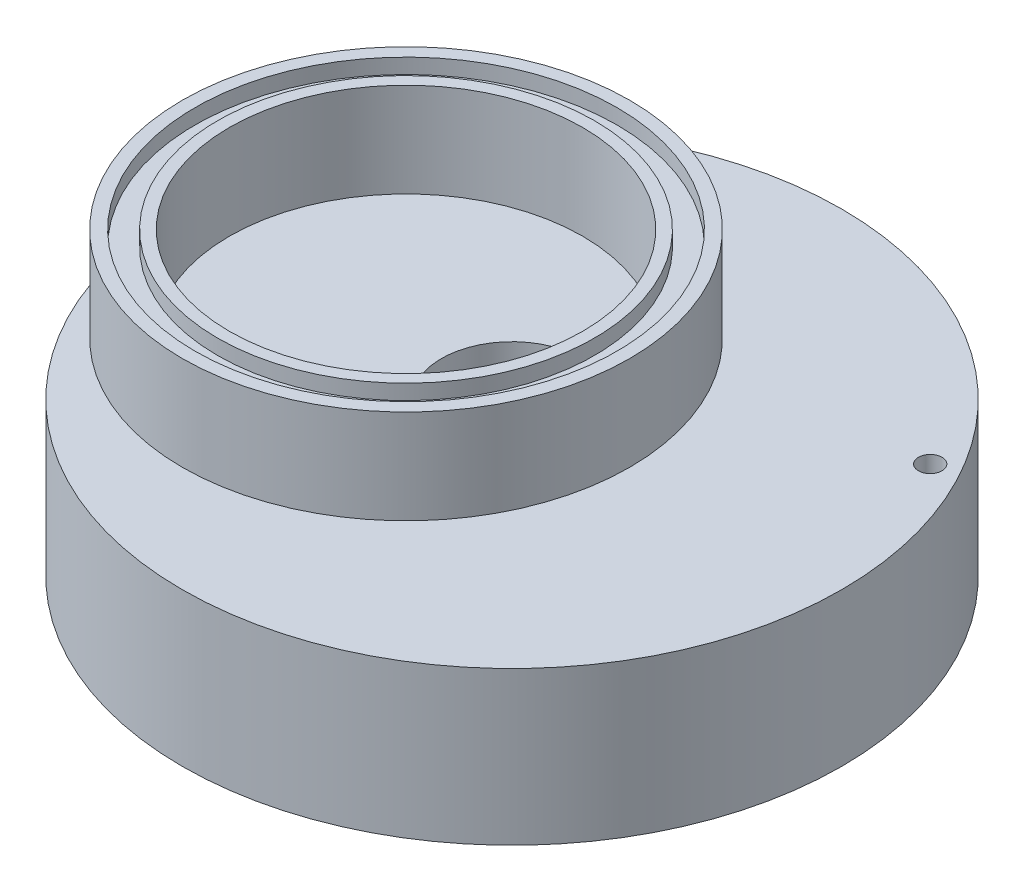
ISO-10303-21;
HEADER;
FILE_DESCRIPTION(('STEP AP214'),'2;1');
FILE_NAME('part.step','',(''),(''),'','','');
FILE_SCHEMA(('AUTOMOTIVE_DESIGN { 1 0 10303 214 1 1 1 1 }'));
ENDSEC;
DATA;
#1=APPLICATION_CONTEXT('core data for automotive mechanical design processes');
#2=APPLICATION_PROTOCOL_DEFINITION('international standard','automotive_design',2000,#1);
#3=PRODUCT_CONTEXT('',#1,'mechanical');
#4=PRODUCT('Part','Part','',(#3));
#5=PRODUCT_RELATED_PRODUCT_CATEGORY('part','',(#4));
#6=PRODUCT_DEFINITION_FORMATION('','',#4);
#7=PRODUCT_DEFINITION_CONTEXT('part definition',#1,'design');
#8=PRODUCT_DEFINITION('design','',#6,#7);
#9=PRODUCT_DEFINITION_SHAPE('','',#8);
#10=(LENGTH_UNIT() NAMED_UNIT(*) SI_UNIT(.MILLI.,.METRE.));
#11=(NAMED_UNIT(*) PLANE_ANGLE_UNIT() SI_UNIT($,.RADIAN.));
#12=(NAMED_UNIT(*) SI_UNIT($,.STERADIAN.) SOLID_ANGLE_UNIT());
#13=UNCERTAINTY_MEASURE_WITH_UNIT(LENGTH_MEASURE(1.E-05),#10,'distance_accuracy_value','');
#14=(GEOMETRIC_REPRESENTATION_CONTEXT(3) GLOBAL_UNCERTAINTY_ASSIGNED_CONTEXT((#13)) GLOBAL_UNIT_ASSIGNED_CONTEXT((#10,
#11,#12)) REPRESENTATION_CONTEXT('',''));
#15=CARTESIAN_POINT('',(0.,0.,0.));
#16=DIRECTION('',(0.,0.,1.));
#17=DIRECTION('',(1.,0.,0.));
#18=AXIS2_PLACEMENT_3D('',#15,#16,#17);
#19=CARTESIAN_POINT('',(-14.2875,12.7,0.));
#20=DIRECTION('',(0.,1.,0.));
#21=DIRECTION('',(0.,0.,1.));
#22=AXIS2_PLACEMENT_3D('',#19,#20,#21);
#23=PLANE('',#22);
#24=CARTESIAN_POINT('',(-14.2875,12.7,0.));
#25=DIRECTION('',(0.,1.,0.));
#26=DIRECTION('',(0.,0.,1.));
#27=AXIS2_PLACEMENT_3D('',#24,#25,#26);
#28=CIRCLE('',#27,23.8125);
#29=CARTESIAN_POINT('',(-14.2875,12.7,23.8125));
#30=VERTEX_POINT('',#29);
#31=EDGE_CURVE('E107',#30,#30,#28,.T.);
#32=ORIENTED_EDGE('',*,*,#31,.F.);
#33=EDGE_LOOP('',(#32));
#34=FACE_BOUND('',#33,.T.);
#35=CARTESIAN_POINT('',(-14.2875,12.7,0.));
#36=DIRECTION('',(0.,1.,0.));
#37=DIRECTION('',(0.,0.,1.));
#38=AXIS2_PLACEMENT_3D('',#35,#36,#37);
#39=CIRCLE('',#38,25.4);
#40=CARTESIAN_POINT('',(-14.2875,12.7,25.4));
#41=VERTEX_POINT('',#40);
#42=EDGE_CURVE('E91',#41,#41,#39,.T.);
#43=ORIENTED_EDGE('',*,*,#42,.T.);
#44=EDGE_LOOP('',(#43));
#45=FACE_BOUND('',#44,.T.);
#46=ADVANCED_FACE('F39',(#34,#45),#23,.T.);
#47=CARTESIAN_POINT('',(-9.525,0.,0.));
#48=DIRECTION('',(0.,-1.,0.));
#49=DIRECTION('',(0.,0.,-1.));
#50=AXIS2_PLACEMENT_3D('',#47,#48,#49);
#51=PLANE('',#50);
#52=CARTESIAN_POINT('',(0.,0.,0.));
#53=DIRECTION('',(0.,-1.,0.));
#54=DIRECTION('',(0.,0.,-1.));
#55=AXIS2_PLACEMENT_3D('',#52,#53,#54);
#56=CIRCLE('',#55,9.525);
#57=CARTESIAN_POINT('',(9.525,0.,0.));
#58=VERTEX_POINT('',#57);
#59=EDGE_CURVE('E125',#58,#58,#56,.T.);
#60=ORIENTED_EDGE('',*,*,#59,.T.);
#61=CARTESIAN_POINT('',(-14.2875,0.,0.));
#62=DIRECTION('',(0.,1.,0.));
#63=DIRECTION('',(0.,0.,1.));
#64=AXIS2_PLACEMENT_3D('',#61,#62,#63);
#65=CIRCLE('',#64,23.8125);
#66=EDGE_CURVE('E53',#58,#58,#65,.T.);
#67=ORIENTED_EDGE('',*,*,#66,.T.);
#68=EDGE_LOOP('',(#60,#67));
#69=FACE_BOUND('',#68,.T.);
#70=ADVANCED_FACE('F222',(#69),#51,.F.);
#71=CARTESIAN_POINT('',(-9.525,-6.35,0.));
#72=DIRECTION('',(0.,1.,0.));
#73=DIRECTION('',(0.,0.,1.));
#74=AXIS2_PLACEMENT_3D('',#71,#72,#73);
#75=PLANE('',#74);
#76=CARTESIAN_POINT('',(0.,-6.35,0.));
#77=DIRECTION('',(0.,-1.,0.));
#78=DIRECTION('',(0.,0.,-1.));
#79=AXIS2_PLACEMENT_3D('',#76,#77,#78);
#80=CIRCLE('',#79,9.525);
#81=CARTESIAN_POINT('',(0.,-6.35,-9.525));
#82=VERTEX_POINT('',#81);
#83=EDGE_CURVE('E118',#82,#82,#80,.T.);
#84=ORIENTED_EDGE('',*,*,#83,.F.);
#85=EDGE_LOOP('',(#84));
#86=FACE_BOUND('',#85,.T.);
#87=CARTESIAN_POINT('',(0.,-6.35,0.));
#88=DIRECTION('',(0.,-1.,0.));
#89=DIRECTION('',(0.,0.,-1.));
#90=AXIS2_PLACEMENT_3D('',#87,#88,#89);
#91=CIRCLE('',#90,15.875);
#92=CARTESIAN_POINT('',(0.,-6.35,-15.875));
#93=VERTEX_POINT('',#92);
#94=EDGE_CURVE('E11',#93,#93,#91,.T.);
#95=ORIENTED_EDGE('',*,*,#94,.T.);
#96=EDGE_LOOP('',(#95));
#97=FACE_BOUND('',#96,.T.);
#98=ADVANCED_FACE('F41',(#86,#97),#75,.F.);
#99=CARTESIAN_POINT('',(0.,-19.05,0.));
#100=DIRECTION('',(0.,-1.,0.));
#101=DIRECTION('',(0.,0.,-1.));
#102=AXIS2_PLACEMENT_3D('',#99,#100,#101);
#103=CONICAL_SURFACE('',#102,31.75,0.896055384571344);
#104=ORIENTED_EDGE('',*,*,#94,.F.);
#105=EDGE_LOOP('',(#104));
#106=FACE_BOUND('',#105,.T.);
#107=CARTESIAN_POINT('',(0.,-19.05,0.));
#108=DIRECTION('',(0.,-1.,0.));
#109=DIRECTION('',(0.,0.,-1.));
#110=AXIS2_PLACEMENT_3D('',#107,#108,#109);
#111=CIRCLE('',#110,31.75);
#112=CARTESIAN_POINT('',(0.,-19.05,-31.75));
#113=VERTEX_POINT('',#112);
#114=EDGE_CURVE('E48',#113,#113,#111,.T.);
#115=ORIENTED_EDGE('',*,*,#114,.T.);
#116=EDGE_LOOP('',(#115));
#117=FACE_BOUND('',#116,.T.);
#118=ADVANCED_FACE('F158',(#106,#117),#103,.F.);
#119=CARTESIAN_POINT('',(0.,0.,0.));
#120=DIRECTION('',(0.,-1.,0.));
#121=DIRECTION('',(0.,0.,-1.));
#122=AXIS2_PLACEMENT_3D('',#119,#120,#121);
#123=CYLINDRICAL_SURFACE('',#122,31.75);
#124=ORIENTED_EDGE('',*,*,#114,.F.);
#125=EDGE_LOOP('',(#124));
#126=FACE_BOUND('',#125,.T.);
#127=CARTESIAN_POINT('',(0.,-20.6375,0.));
#128=DIRECTION('',(0.,-1.,0.));
#129=DIRECTION('',(0.,0.,-1.));
#130=AXIS2_PLACEMENT_3D('',#127,#128,#129);
#131=CIRCLE('',#130,31.75);
#132=CARTESIAN_POINT('',(0.,-20.6375,-31.75));
#133=VERTEX_POINT('',#132);
#134=EDGE_CURVE('E151',#133,#133,#131,.T.);
#135=ORIENTED_EDGE('',*,*,#134,.T.);
#136=EDGE_LOOP('',(#135));
#137=FACE_BOUND('',#136,.T.);
#138=ADVANCED_FACE('F160',(#126,#137),#123,.F.);
#139=CARTESIAN_POINT('',(-33.3375,-20.6375,0.));
#140=DIRECTION('',(0.,1.,0.));
#141=DIRECTION('',(0.,0.,1.));
#142=AXIS2_PLACEMENT_3D('',#139,#140,#141);
#143=PLANE('',#142);
#144=ORIENTED_EDGE('',*,*,#134,.F.);
#145=EDGE_LOOP('',(#144));
#146=FACE_BOUND('',#145,.T.);
#147=CARTESIAN_POINT('',(0.,-20.6375,0.));
#148=DIRECTION('',(0.,-1.,0.));
#149=DIRECTION('',(0.,0.,-1.));
#150=AXIS2_PLACEMENT_3D('',#147,#148,#149);
#151=CIRCLE('',#150,33.3375);
#152=CARTESIAN_POINT('',(0.,-20.6375,-33.3375));
#153=VERTEX_POINT('',#152);
#154=EDGE_CURVE('E147',#153,#153,#151,.T.);
#155=ORIENTED_EDGE('',*,*,#154,.T.);
#156=EDGE_LOOP('',(#155));
#157=FACE_BOUND('',#156,.T.);
#158=ADVANCED_FACE('F163',(#146,#157),#143,.F.);
#159=CARTESIAN_POINT('',(0.,0.,0.));
#160=DIRECTION('',(0.,-1.,0.));
#161=DIRECTION('',(0.,0.,-1.));
#162=AXIS2_PLACEMENT_3D('',#159,#160,#161);
#163=CYLINDRICAL_SURFACE('',#162,33.3375);
#164=ORIENTED_EDGE('',*,*,#154,.F.);
#165=EDGE_LOOP('',(#164));
#166=FACE_BOUND('',#165,.T.);
#167=CARTESIAN_POINT('',(0.,-18.6055,0.));
#168=DIRECTION('',(0.,-1.,0.));
#169=DIRECTION('',(0.,0.,-1.));
#170=AXIS2_PLACEMENT_3D('',#167,#168,#169);
#171=CIRCLE('',#170,33.3375);
#172=CARTESIAN_POINT('',(0.,-18.6055,-33.3375));
#173=VERTEX_POINT('',#172);
#174=EDGE_CURVE('E143',#173,#173,#171,.T.);
#175=ORIENTED_EDGE('',*,*,#174,.T.);
#176=EDGE_LOOP('',(#175));
#177=FACE_BOUND('',#176,.T.);
#178=ADVANCED_FACE('F169',(#166,#177),#163,.T.);
#179=CARTESIAN_POINT('',(-36.3855,-18.6055,0.));
#180=DIRECTION('',(0.,1.,0.));
#181=DIRECTION('',(0.,0.,1.));
#182=AXIS2_PLACEMENT_3D('',#179,#180,#181);
#183=PLANE('',#182);
#184=ORIENTED_EDGE('',*,*,#174,.F.);
#185=EDGE_LOOP('',(#184));
#186=FACE_BOUND('',#185,.T.);
#187=CARTESIAN_POINT('',(0.,-18.6055,0.));
#188=DIRECTION('',(0.,-1.,0.));
#189=DIRECTION('',(0.,0.,-1.));
#190=AXIS2_PLACEMENT_3D('',#187,#188,#189);
#191=CIRCLE('',#190,36.3855);
#192=CARTESIAN_POINT('',(0.,-18.6055,-36.3855));
#193=VERTEX_POINT('',#192);
#194=EDGE_CURVE('E139',#193,#193,#191,.T.);
#195=ORIENTED_EDGE('',*,*,#194,.T.);
#196=EDGE_LOOP('',(#195));
#197=FACE_BOUND('',#196,.T.);
#198=ADVANCED_FACE('F175',(#186,#197),#183,.F.);
#199=CARTESIAN_POINT('',(0.,0.,0.));
#200=DIRECTION('',(0.,-1.,0.));
#201=DIRECTION('',(0.,0.,-1.));
#202=AXIS2_PLACEMENT_3D('',#199,#200,#201);
#203=CYLINDRICAL_SURFACE('',#202,36.3855);
#204=ORIENTED_EDGE('',*,*,#194,.F.);
#205=EDGE_LOOP('',(#204));
#206=FACE_BOUND('',#205,.T.);
#207=CARTESIAN_POINT('',(0.,-20.6375,0.));
#208=DIRECTION('',(0.,-1.,0.));
#209=DIRECTION('',(0.,0.,-1.));
#210=AXIS2_PLACEMENT_3D('',#207,#208,#209);
#211=CIRCLE('',#210,36.3855);
#212=CARTESIAN_POINT('',(0.,-20.6375,-36.3855));
#213=VERTEX_POINT('',#212);
#214=EDGE_CURVE('E135',#213,#213,#211,.T.);
#215=ORIENTED_EDGE('',*,*,#214,.T.);
#216=EDGE_LOOP('',(#215));
#217=FACE_BOUND('',#216,.T.);
#218=ADVANCED_FACE('F181',(#206,#217),#203,.F.);
#219=CARTESIAN_POINT('',(-44.45,-20.6375,0.));
#220=DIRECTION('',(0.,1.,0.));
#221=DIRECTION('',(0.,0.,1.));
#222=AXIS2_PLACEMENT_3D('',#219,#220,#221);
#223=PLANE('',#222);
#224=CARTESIAN_POINT('',(41.275,-20.6375,0.));
#225=DIRECTION('',(0.,-1.,0.));
#226=DIRECTION('',(0.,0.,-1.));
#227=AXIS2_PLACEMENT_3D('',#224,#225,#226);
#228=CIRCLE('',#227,1.58749999999999);
#229=CARTESIAN_POINT('',(41.275,-20.6375,-1.58749999999999));
#230=VERTEX_POINT('',#229);
#231=EDGE_CURVE('E77',#230,#230,#228,.T.);
#232=ORIENTED_EDGE('',*,*,#231,.F.);
#233=EDGE_LOOP('',(#232));
#234=FACE_BOUND('',#233,.T.);
#235=ORIENTED_EDGE('',*,*,#214,.F.);
#236=EDGE_LOOP('',(#235));
#237=FACE_BOUND('',#236,.T.);
#238=CARTESIAN_POINT('',(0.,-20.6375,0.));
#239=DIRECTION('',(0.,-1.,0.));
#240=DIRECTION('',(0.,0.,-1.));
#241=AXIS2_PLACEMENT_3D('',#238,#239,#240);
#242=CIRCLE('',#241,44.45);
#243=CARTESIAN_POINT('',(0.,-20.6375,-44.45));
#244=VERTEX_POINT('',#243);
#245=EDGE_CURVE('E131',#244,#244,#242,.T.);
#246=ORIENTED_EDGE('',*,*,#245,.T.);
#247=EDGE_LOOP('',(#246));
#248=FACE_BOUND('',#247,.T.);
#249=ADVANCED_FACE('F187',(#234,#237,#248),#223,.F.);
#250=CARTESIAN_POINT('',(0.,0.,0.));
#251=DIRECTION('',(0.,-1.,0.));
#252=DIRECTION('',(0.,0.,-1.));
#253=AXIS2_PLACEMENT_3D('',#250,#251,#252);
#254=CYLINDRICAL_SURFACE('',#253,44.45);
#255=ORIENTED_EDGE('',*,*,#245,.F.);
#256=EDGE_LOOP('',(#255));
#257=FACE_BOUND('',#256,.T.);
#258=CARTESIAN_POINT('',(0.,0.,0.));
#259=DIRECTION('',(0.,-1.,0.));
#260=DIRECTION('',(0.,0.,-1.));
#261=AXIS2_PLACEMENT_3D('',#258,#259,#260);
#262=CIRCLE('',#261,44.45);
#263=CARTESIAN_POINT('',(-44.45,0.,0.));
#264=VERTEX_POINT('',#263);
#265=EDGE_CURVE('E59',#264,#264,#262,.T.);
#266=ORIENTED_EDGE('',*,*,#265,.T.);
#267=EDGE_LOOP('',(#266));
#268=FACE_BOUND('',#267,.T.);
#269=ADVANCED_FACE('F193',(#257,#268),#254,.T.);
#270=CARTESIAN_POINT('',(35.7451985412027,0.,-20.6375000000001));
#271=DIRECTION('',(0.,1.,0.));
#272=DIRECTION('',(0.,0.,1.));
#273=AXIS2_PLACEMENT_3D('',#270,#271,#272);
#274=CIRCLE('',#273,1.58749999999999);
#275=CARTESIAN_POINT('',(35.7451985412027,0.,-19.0500000000001));
#276=VERTEX_POINT('',#275);
#277=EDGE_CURVE('E78',#276,#276,#274,.T.);
#278=ORIENTED_EDGE('',*,*,#277,.F.);
#279=EDGE_LOOP('',(#278));
#280=FACE_BOUND('',#279,.T.);
#281=ORIENTED_EDGE('',*,*,#265,.F.);
#282=CARTESIAN_POINT('',(-14.2875,0.,0.));
#283=DIRECTION('',(0.,1.,0.));
#284=DIRECTION('',(0.,0.,1.));
#285=AXIS2_PLACEMENT_3D('',#282,#283,#284);
#286=CIRCLE('',#285,30.1625);
#287=EDGE_CURVE('E111',#264,#264,#286,.T.);
#288=ORIENTED_EDGE('',*,*,#287,.F.);
#289=EDGE_LOOP('',(#281,#288));
#290=FACE_BOUND('',#289,.T.);
#291=ADVANCED_FACE('F200',(#280,#290),#51,.F.);
#292=CARTESIAN_POINT('',(0.,0.,0.));
#293=DIRECTION('',(0.,-1.,0.));
#294=DIRECTION('',(0.,0.,-1.));
#295=AXIS2_PLACEMENT_3D('',#292,#293,#294);
#296=CYLINDRICAL_SURFACE('',#295,9.525);
#297=ORIENTED_EDGE('',*,*,#59,.F.);
#298=EDGE_LOOP('',(#297));
#299=FACE_BOUND('',#298,.T.);
#300=ORIENTED_EDGE('',*,*,#83,.T.);
#301=EDGE_LOOP('',(#300));
#302=FACE_BOUND('',#301,.T.);
#303=ADVANCED_FACE('F216',(#299,#302),#296,.F.);
#304=CARTESIAN_POINT('',(-14.2875,12.7,0.));
#305=DIRECTION('',(0.,1.,0.));
#306=DIRECTION('',(0.,0.,1.));
#307=AXIS2_PLACEMENT_3D('',#304,#305,#306);
#308=CIRCLE('',#307,28.448);
#309=CARTESIAN_POINT('',(-14.2875,12.7,28.448));
#310=VERTEX_POINT('',#309);
#311=EDGE_CURVE('E96',#310,#310,#308,.T.);
#312=ORIENTED_EDGE('',*,*,#311,.F.);
#313=EDGE_LOOP('',(#312));
#314=FACE_BOUND('',#313,.T.);
#315=CARTESIAN_POINT('',(-14.2875,12.7,0.));
#316=DIRECTION('',(0.,1.,0.));
#317=DIRECTION('',(0.,0.,1.));
#318=AXIS2_PLACEMENT_3D('',#315,#316,#317);
#319=CIRCLE('',#318,30.1625);
#320=CARTESIAN_POINT('',(-14.2875,12.7,30.1625));
#321=VERTEX_POINT('',#320);
#322=EDGE_CURVE('E114',#321,#321,#319,.T.);
#323=ORIENTED_EDGE('',*,*,#322,.T.);
#324=EDGE_LOOP('',(#323));
#325=FACE_BOUND('',#324,.T.);
#326=ADVANCED_FACE('F206',(#314,#325),#23,.T.);
#327=CARTESIAN_POINT('',(-14.2875,12.7,0.));
#328=DIRECTION('',(0.,-1.,0.));
#329=DIRECTION('',(0.,0.,-1.));
#330=AXIS2_PLACEMENT_3D('',#327,#328,#329);
#331=CYLINDRICAL_SURFACE('',#330,30.1625);
#332=ORIENTED_EDGE('',*,*,#322,.F.);
#333=EDGE_LOOP('',(#332));
#334=FACE_BOUND('',#333,.T.);
#335=ORIENTED_EDGE('',*,*,#287,.T.);
#336=EDGE_LOOP('',(#335));
#337=FACE_BOUND('',#336,.T.);
#338=ADVANCED_FACE('F203',(#334,#337),#331,.T.);
#339=CARTESIAN_POINT('',(-14.2875,12.7,0.));
#340=DIRECTION('',(0.,-1.,0.));
#341=DIRECTION('',(0.,0.,-1.));
#342=AXIS2_PLACEMENT_3D('',#339,#340,#341);
#343=CYLINDRICAL_SURFACE('',#342,23.8125);
#344=ORIENTED_EDGE('',*,*,#31,.T.);
#345=EDGE_LOOP('',(#344));
#346=FACE_BOUND('',#345,.T.);
#347=ORIENTED_EDGE('',*,*,#66,.F.);
#348=EDGE_LOOP('',(#347));
#349=FACE_BOUND('',#348,.T.);
#350=ADVANCED_FACE('F205',(#346,#349),#343,.F.);
#351=CARTESIAN_POINT('',(-14.2875,10.668,0.));
#352=DIRECTION('',(0.,1.,0.));
#353=DIRECTION('',(0.,0.,1.));
#354=AXIS2_PLACEMENT_3D('',#351,#352,#353);
#355=CYLINDRICAL_SURFACE('',#354,28.448);
#356=CARTESIAN_POINT('',(-14.2875,10.668,0.));
#357=DIRECTION('',(0.,1.,0.));
#358=DIRECTION('',(0.,0.,1.));
#359=AXIS2_PLACEMENT_3D('',#356,#357,#358);
#360=CIRCLE('',#359,28.448);
#361=CARTESIAN_POINT('',(-14.2875,10.668,28.448));
#362=VERTEX_POINT('',#361);
#363=EDGE_CURVE('E100',#362,#362,#360,.T.);
#364=ORIENTED_EDGE('',*,*,#363,.F.);
#365=EDGE_LOOP('',(#364));
#366=FACE_BOUND('',#365,.T.);
#367=ORIENTED_EDGE('',*,*,#311,.T.);
#368=EDGE_LOOP('',(#367));
#369=FACE_BOUND('',#368,.T.);
#370=ADVANCED_FACE('F213',(#366,#369),#355,.F.);
#371=CARTESIAN_POINT('',(-14.2875,10.668,0.));
#372=DIRECTION('',(0.,1.,0.));
#373=DIRECTION('',(0.,0.,1.));
#374=AXIS2_PLACEMENT_3D('',#371,#372,#373);
#375=PLANE('',#374);
#376=CARTESIAN_POINT('',(-14.2875,10.668,0.));
#377=DIRECTION('',(0.,1.,0.));
#378=DIRECTION('',(0.,0.,1.));
#379=AXIS2_PLACEMENT_3D('',#376,#377,#378);
#380=CIRCLE('',#379,25.4);
#381=CARTESIAN_POINT('',(-14.2875,10.668,25.4));
#382=VERTEX_POINT('',#381);
#383=EDGE_CURVE('E92',#382,#382,#380,.T.);
#384=ORIENTED_EDGE('',*,*,#383,.F.);
#385=EDGE_LOOP('',(#384));
#386=FACE_BOUND('',#385,.T.);
#387=ORIENTED_EDGE('',*,*,#363,.T.);
#388=EDGE_LOOP('',(#387));
#389=FACE_BOUND('',#388,.T.);
#390=ADVANCED_FACE('F234',(#386,#389),#375,.T.);
#391=CARTESIAN_POINT('',(-14.2875,10.668,0.));
#392=DIRECTION('',(0.,1.,0.));
#393=DIRECTION('',(0.,0.,1.));
#394=AXIS2_PLACEMENT_3D('',#391,#392,#393);
#395=CYLINDRICAL_SURFACE('',#394,25.4);
#396=ORIENTED_EDGE('',*,*,#383,.T.);
#397=EDGE_LOOP('',(#396));
#398=FACE_BOUND('',#397,.T.);
#399=ORIENTED_EDGE('',*,*,#42,.F.);
#400=EDGE_LOOP('',(#399));
#401=FACE_BOUND('',#400,.T.);
#402=ADVANCED_FACE('F238',(#398,#401),#395,.T.);
#403=CARTESIAN_POINT('',(41.275,-14.2875,0.));
#404=DIRECTION('',(0.,-1.,0.));
#405=DIRECTION('',(0.,0.,-1.));
#406=AXIS2_PLACEMENT_3D('',#403,#404,#405);
#407=CONICAL_SURFACE('',#406,1.5875,1.02974425867665);
#408=CARTESIAN_POINT('',(41.275,-13.3336337672938,0.));
#409=VERTEX_POINT('',#408);
#410=VERTEX_LOOP('',#409);
#411=FACE_BOUND('',#410,.T.);
#412=CARTESIAN_POINT('',(41.275,-14.2875,0.));
#413=DIRECTION('',(0.,-1.,0.));
#414=DIRECTION('',(0.,0.,-1.));
#415=AXIS2_PLACEMENT_3D('',#412,#413,#414);
#416=CIRCLE('',#415,1.5875);
#417=CARTESIAN_POINT('',(41.275,-14.2875,-1.5875));
#418=VERTEX_POINT('',#417);
#419=EDGE_CURVE('E83',#418,#418,#416,.T.);
#420=ORIENTED_EDGE('',*,*,#419,.T.);
#421=EDGE_LOOP('',(#420));
#422=FACE_BOUND('',#421,.T.);
#423=ADVANCED_FACE('F242',(#411,#422),#407,.F.);
#424=CARTESIAN_POINT('',(41.275,-20.6375,0.));
#425=DIRECTION('',(0.,-1.,0.));
#426=DIRECTION('',(0.,0.,-1.));
#427=AXIS2_PLACEMENT_3D('',#424,#425,#426);
#428=CYLINDRICAL_SURFACE('',#427,1.5875);
#429=ORIENTED_EDGE('',*,*,#419,.F.);
#430=EDGE_LOOP('',(#429));
#431=FACE_BOUND('',#430,.T.);
#432=ORIENTED_EDGE('',*,*,#231,.T.);
#433=EDGE_LOOP('',(#432));
#434=FACE_BOUND('',#433,.T.);
#435=ADVANCED_FACE('F70',(#431,#434),#428,.F.);
#436=CARTESIAN_POINT('',(35.7451985412027,-6.35,-20.6375000000001));
#437=DIRECTION('',(0.,1.,0.));
#438=DIRECTION('',(0.,0.,1.));
#439=AXIS2_PLACEMENT_3D('',#436,#437,#438);
#440=CONICAL_SURFACE('',#439,1.5875,1.02974425867665);
#441=CARTESIAN_POINT('',(35.7451985412027,-7.30386623270625,-20.6375000000001));
#442=VERTEX_POINT('',#441);
#443=VERTEX_LOOP('',#442);
#444=FACE_BOUND('',#443,.T.);
#445=CARTESIAN_POINT('',(35.7451985412027,-6.35,-20.6375000000001));
#446=DIRECTION('',(0.,1.,0.));
#447=DIRECTION('',(0.,0.,1.));
#448=AXIS2_PLACEMENT_3D('',#445,#446,#447);
#449=CIRCLE('',#448,1.5875);
#450=CARTESIAN_POINT('',(35.7451985412027,-6.35,-19.0500000000001));
#451=VERTEX_POINT('',#450);
#452=EDGE_CURVE('E74',#451,#451,#449,.T.);
#453=ORIENTED_EDGE('',*,*,#452,.T.);
#454=EDGE_LOOP('',(#453));
#455=FACE_BOUND('',#454,.T.);
#456=ADVANCED_FACE('F66',(#444,#455),#440,.F.);
#457=CARTESIAN_POINT('',(35.7451985412027,0.,-20.6375000000001));
#458=DIRECTION('',(0.,1.,0.));
#459=DIRECTION('',(0.,0.,1.));
#460=AXIS2_PLACEMENT_3D('',#457,#458,#459);
#461=CYLINDRICAL_SURFACE('',#460,1.5875);
#462=ORIENTED_EDGE('',*,*,#452,.F.);
#463=EDGE_LOOP('',(#462));
#464=FACE_BOUND('',#463,.T.);
#465=ORIENTED_EDGE('',*,*,#277,.T.);
#466=EDGE_LOOP('',(#465));
#467=FACE_BOUND('',#466,.T.);
#468=ADVANCED_FACE('F69',(#464,#467),#461,.F.);
#469=CLOSED_SHELL('',(#46,#70,#98,#118,#138,#158,#178,#198,#218,#249,#269,#291,#303,#326,#338,
#350,#370,#390,#402,#423,#435,#456,#468));
#470=MANIFOLD_SOLID_BREP('B2',#469);
#471=ADVANCED_BREP_SHAPE_REPRESENTATION('',(#18,#470),#14);
#472=SHAPE_DEFINITION_REPRESENTATION(#9,#471);
ENDSEC;
END-ISO-10303-21;
